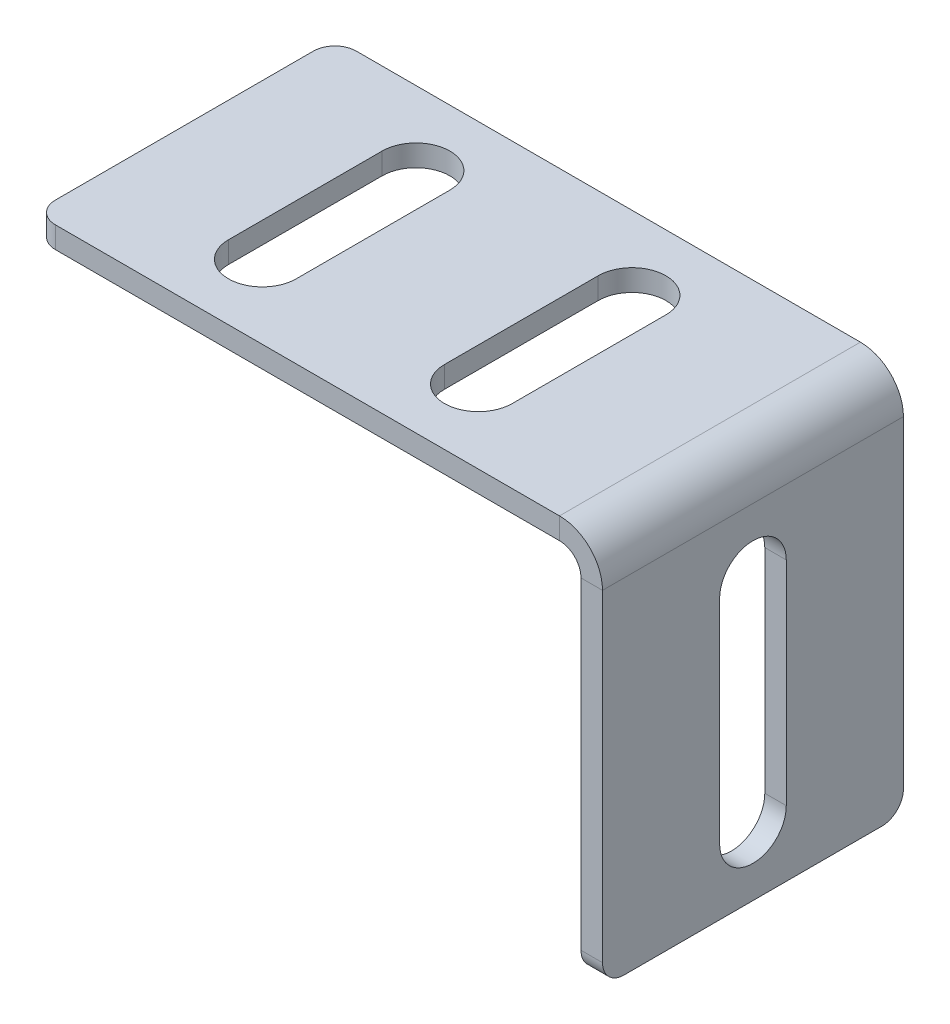
ISO-10303-21;
HEADER;
FILE_DESCRIPTION(('STEP AP214'),'2;1');
FILE_NAME('part.step','',(''),(''),'','','');
FILE_SCHEMA(('AUTOMOTIVE_DESIGN { 1 0 10303 214 1 1 1 1 }'));
ENDSEC;
DATA;
#1=APPLICATION_CONTEXT('core data for automotive mechanical design processes');
#2=APPLICATION_PROTOCOL_DEFINITION('international standard','automotive_design',2000,#1);
#3=PRODUCT_CONTEXT('',#1,'mechanical');
#4=PRODUCT('Part','Part','',(#3));
#5=PRODUCT_RELATED_PRODUCT_CATEGORY('part','',(#4));
#6=PRODUCT_DEFINITION_FORMATION('','',#4);
#7=PRODUCT_DEFINITION_CONTEXT('part definition',#1,'design');
#8=PRODUCT_DEFINITION('design','',#6,#7);
#9=PRODUCT_DEFINITION_SHAPE('','',#8);
#10=(LENGTH_UNIT() NAMED_UNIT(*) SI_UNIT(.MILLI.,.METRE.));
#11=(NAMED_UNIT(*) PLANE_ANGLE_UNIT() SI_UNIT($,.RADIAN.));
#12=(NAMED_UNIT(*) SI_UNIT($,.STERADIAN.) SOLID_ANGLE_UNIT());
#13=UNCERTAINTY_MEASURE_WITH_UNIT(LENGTH_MEASURE(1.E-05),#10,'distance_accuracy_value','');
#14=(GEOMETRIC_REPRESENTATION_CONTEXT(3) GLOBAL_UNCERTAINTY_ASSIGNED_CONTEXT((#13)) GLOBAL_UNIT_ASSIGNED_CONTEXT((#10,
#11,#12)) REPRESENTATION_CONTEXT('',''));
#15=CARTESIAN_POINT('',(0.,0.,0.));
#16=DIRECTION('',(0.,0.,1.));
#17=DIRECTION('',(1.,0.,0.));
#18=AXIS2_PLACEMENT_3D('',#15,#16,#17);
#19=CARTESIAN_POINT('',(-2.,0.,0.));
#20=DIRECTION('',(0.,0.,1.));
#21=DIRECTION('',(0.,1.,0.));
#22=AXIS2_PLACEMENT_3D('',#19,#20,#21);
#23=PLANE('',#22);
#24=DIRECTION('',(0.,-1.,0.));
#25=VECTOR('',#24,1.);
#26=CARTESIAN_POINT('',(0.,0.,0.));
#27=LINE('',#26,#25);
#28=CARTESIAN_POINT('',(0.,-34.,0.));
#29=VERTEX_POINT('',#28);
#30=CARTESIAN_POINT('',(0.,-4.,0.));
#31=VERTEX_POINT('',#30);
#32=EDGE_CURVE('E329',#29,#31,#27,.F.);
#33=ORIENTED_EDGE('',*,*,#32,.F.);
#34=DIRECTION('',(1.,0.,0.));
#35=VECTOR('',#34,1.);
#36=CARTESIAN_POINT('',(-2.,-34.,0.));
#37=LINE('',#36,#35);
#38=CARTESIAN_POINT('',(-2.,-34.,0.));
#39=VERTEX_POINT('',#38);
#40=EDGE_CURVE('E343',#29,#39,#37,.F.);
#41=ORIENTED_EDGE('',*,*,#40,.T.);
#42=DIRECTION('',(0.,1.,0.));
#43=VECTOR('',#42,1.);
#44=CARTESIAN_POINT('',(-2.,0.,0.));
#45=LINE('',#44,#43);
#46=CARTESIAN_POINT('',(-2.,-4.,0.));
#47=VERTEX_POINT('',#46);
#48=EDGE_CURVE('E282',#39,#47,#45,.T.);
#49=ORIENTED_EDGE('',*,*,#48,.T.);
#50=DIRECTION('',(-1.,0.,0.));
#51=VECTOR('',#50,1.);
#52=CARTESIAN_POINT('',(-2.,-4.,0.));
#53=LINE('',#52,#51);
#54=EDGE_CURVE('E340',#31,#47,#53,.T.);
#55=ORIENTED_EDGE('',*,*,#54,.F.);
#56=EDGE_LOOP('',(#33,#41,#49,#55));
#57=FACE_BOUND('',#56,.T.);
#58=ADVANCED_FACE('F16',(#57),#23,.F.);
#59=CARTESIAN_POINT('',(-2.,-36.,91.9875769192738));
#60=DIRECTION('',(0.,1.,0.));
#61=DIRECTION('',(0.,0.,-1.));
#62=AXIS2_PLACEMENT_3D('',#59,#60,#61);
#63=PLANE('',#62);
#64=DIRECTION('',(0.,0.,-1.));
#65=VECTOR('',#64,1.);
#66=CARTESIAN_POINT('',(-2.,-36.,91.9875769192738));
#67=LINE('',#66,#65);
#68=CARTESIAN_POINT('',(-2.,-36.,25.9999999999999));
#69=VERTEX_POINT('',#68);
#70=CARTESIAN_POINT('',(-2.,-36.,2.));
#71=VERTEX_POINT('',#70);
#72=EDGE_CURVE('E285',#69,#71,#67,.T.);
#73=ORIENTED_EDGE('',*,*,#72,.T.);
#74=DIRECTION('',(1.,0.,0.));
#75=VECTOR('',#74,1.);
#76=CARTESIAN_POINT('',(-2.,-36.,2.));
#77=LINE('',#76,#75);
#78=CARTESIAN_POINT('',(0.,-36.,2.));
#79=VERTEX_POINT('',#78);
#80=EDGE_CURVE('E354',#71,#79,#77,.T.);
#81=ORIENTED_EDGE('',*,*,#80,.T.);
#82=DIRECTION('',(0.,0.,1.));
#83=VECTOR('',#82,1.);
#84=CARTESIAN_POINT('',(0.,-36.,91.9875769192738));
#85=LINE('',#84,#83);
#86=CARTESIAN_POINT('',(0.,-36.,25.9999999999999));
#87=VERTEX_POINT('',#86);
#88=EDGE_CURVE('E322',#87,#79,#85,.F.);
#89=ORIENTED_EDGE('',*,*,#88,.F.);
#90=DIRECTION('',(1.,0.,0.));
#91=VECTOR('',#90,1.);
#92=CARTESIAN_POINT('',(-2.,-36.,25.9999999999999));
#93=LINE('',#92,#91);
#94=EDGE_CURVE('E351',#87,#69,#93,.F.);
#95=ORIENTED_EDGE('',*,*,#94,.T.);
#96=EDGE_LOOP('',(#73,#81,#89,#95));
#97=FACE_BOUND('',#96,.T.);
#98=ADVANCED_FACE('F434',(#97),#63,.F.);
#99=CARTESIAN_POINT('',(-2.,0.,27.9999999999999));
#100=DIRECTION('',(0.,0.,-1.));
#101=DIRECTION('',(0.,-1.,0.));
#102=AXIS2_PLACEMENT_3D('',#99,#100,#101);
#103=PLANE('',#102);
#104=DIRECTION('',(0.,-1.,0.));
#105=VECTOR('',#104,1.);
#106=CARTESIAN_POINT('',(-2.,0.,27.9999999999999));
#107=LINE('',#106,#105);
#108=CARTESIAN_POINT('',(-2.,-4.,27.9999999999999));
#109=VERTEX_POINT('',#108);
#110=CARTESIAN_POINT('',(-2.,-34.,27.9999999999999));
#111=VERTEX_POINT('',#110);
#112=EDGE_CURVE('E279',#109,#111,#107,.T.);
#113=ORIENTED_EDGE('',*,*,#112,.T.);
#114=DIRECTION('',(1.,0.,0.));
#115=VECTOR('',#114,1.);
#116=CARTESIAN_POINT('',(-2.,-34.,27.9999999999999));
#117=LINE('',#116,#115);
#118=CARTESIAN_POINT('',(0.,-34.,27.9999999999999));
#119=VERTEX_POINT('',#118);
#120=EDGE_CURVE('E360',#111,#119,#117,.T.);
#121=ORIENTED_EDGE('',*,*,#120,.T.);
#122=DIRECTION('',(0.,-1.,0.));
#123=VECTOR('',#122,1.);
#124=CARTESIAN_POINT('',(0.,0.,27.9999999999999));
#125=LINE('',#124,#123);
#126=CARTESIAN_POINT('',(0.,-4.,27.9999999999999));
#127=VERTEX_POINT('',#126);
#128=EDGE_CURVE('E326',#127,#119,#125,.T.);
#129=ORIENTED_EDGE('',*,*,#128,.F.);
#130=DIRECTION('',(-1.,0.,0.));
#131=VECTOR('',#130,1.);
#132=CARTESIAN_POINT('',(-2.,-4.,27.9999999999999));
#133=LINE('',#132,#131);
#134=EDGE_CURVE('E338',#127,#109,#133,.T.);
#135=ORIENTED_EDGE('',*,*,#134,.T.);
#136=EDGE_LOOP('',(#113,#121,#129,#135));
#137=FACE_BOUND('',#136,.T.);
#138=ADVANCED_FACE('F425',(#137),#103,.F.);
#139=CARTESIAN_POINT('',(-4.,-4.,27.9999999999999));
#140=DIRECTION('',(0.,0.,1.));
#141=DIRECTION('',(1.,0.,0.));
#142=AXIS2_PLACEMENT_3D('',#139,#140,#141);
#143=PLANE('',#142);
#144=ORIENTED_EDGE('',*,*,#134,.F.);
#145=CARTESIAN_POINT('',(-4.,-4.,27.9999999999999));
#146=DIRECTION('',(0.,0.,1.));
#147=DIRECTION('',(1.,0.,0.));
#148=AXIS2_PLACEMENT_3D('',#145,#146,#147);
#149=CIRCLE('',#148,4.);
#150=CARTESIAN_POINT('',(-4.,0.,27.9999999999999));
#151=VERTEX_POINT('',#150);
#152=EDGE_CURVE('E323',#127,#151,#149,.T.);
#153=ORIENTED_EDGE('',*,*,#152,.T.);
#154=DIRECTION('',(0.,-1.,0.));
#155=VECTOR('',#154,1.);
#156=CARTESIAN_POINT('',(-4.,-2.,27.9999999999999));
#157=LINE('',#156,#155);
#158=CARTESIAN_POINT('',(-4.,-2.,27.9999999999999));
#159=VERTEX_POINT('',#158);
#160=EDGE_CURVE('E335',#151,#159,#157,.T.);
#161=ORIENTED_EDGE('',*,*,#160,.T.);
#162=CARTESIAN_POINT('',(-4.,-4.,27.9999999999999));
#163=DIRECTION('',(0.,0.,-1.));
#164=DIRECTION('',(-1.,0.,0.));
#165=AXIS2_PLACEMENT_3D('',#162,#163,#164);
#166=CIRCLE('',#165,2.);
#167=EDGE_CURVE('E283',#109,#159,#166,.F.);
#168=ORIENTED_EDGE('',*,*,#167,.F.);
#169=EDGE_LOOP('',(#144,#153,#161,#168));
#170=FACE_BOUND('',#169,.T.);
#171=ADVANCED_FACE('F418',(#170),#143,.T.);
#172=CARTESIAN_POINT('',(0.,-2.,27.9999999999999));
#173=DIRECTION('',(0.,0.,-1.));
#174=DIRECTION('',(1.,0.,0.));
#175=AXIS2_PLACEMENT_3D('',#172,#173,#174);
#176=PLANE('',#175);
#177=DIRECTION('',(1.,0.,0.));
#178=VECTOR('',#177,1.);
#179=CARTESIAN_POINT('',(0.,0.,27.9999999999999));
#180=LINE('',#179,#178);
#181=CARTESIAN_POINT('',(-50.9,0.,27.9999999999999));
#182=VERTEX_POINT('',#181);
#183=EDGE_CURVE('E320',#182,#151,#180,.T.);
#184=ORIENTED_EDGE('',*,*,#183,.F.);
#185=DIRECTION('',(0.,-1.,0.));
#186=VECTOR('',#185,1.);
#187=CARTESIAN_POINT('',(-50.9,-2.00000000000001,27.9999999999999));
#188=LINE('',#187,#186);
#189=CARTESIAN_POINT('',(-50.9,-2.00000000000001,27.9999999999999));
#190=VERTEX_POINT('',#189);
#191=EDGE_CURVE('E362',#182,#190,#188,.T.);
#192=ORIENTED_EDGE('',*,*,#191,.T.);
#193=DIRECTION('',(1.,0.,0.));
#194=VECTOR('',#193,1.);
#195=CARTESIAN_POINT('',(0.,-2.,27.9999999999999));
#196=LINE('',#195,#194);
#197=EDGE_CURVE('E288',#190,#159,#196,.T.);
#198=ORIENTED_EDGE('',*,*,#197,.T.);
#199=ORIENTED_EDGE('',*,*,#160,.F.);
#200=EDGE_LOOP('',(#184,#192,#198,#199));
#201=FACE_BOUND('',#200,.T.);
#202=ADVANCED_FACE('F386',(#201),#176,.F.);
#203=CARTESIAN_POINT('',(-52.9,-2.00000000000001,91.9875769192738));
#204=DIRECTION('',(-1.,0.,0.));
#205=DIRECTION('',(0.,0.,-1.));
#206=AXIS2_PLACEMENT_3D('',#203,#204,#205);
#207=PLANE('',#206);
#208=DIRECTION('',(0.,0.,-1.));
#209=VECTOR('',#208,1.);
#210=CARTESIAN_POINT('',(-52.9,-2.00000000000001,91.9875769192738));
#211=LINE('',#210,#209);
#212=CARTESIAN_POINT('',(-52.9,-2.00000000000001,25.9999999999999));
#213=VERTEX_POINT('',#212);
#214=CARTESIAN_POINT('',(-52.9,-2.00000000000001,2.));
#215=VERTEX_POINT('',#214);
#216=EDGE_CURVE('E290',#213,#215,#211,.T.);
#217=ORIENTED_EDGE('',*,*,#216,.F.);
#218=DIRECTION('',(0.,1.,0.));
#219=VECTOR('',#218,1.);
#220=CARTESIAN_POINT('',(-52.9,-2.00000000000001,25.9999999999999));
#221=LINE('',#220,#219);
#222=CARTESIAN_POINT('',(-52.9,0.,25.9999999999999));
#223=VERTEX_POINT('',#222);
#224=EDGE_CURVE('E372',#213,#223,#221,.T.);
#225=ORIENTED_EDGE('',*,*,#224,.T.);
#226=DIRECTION('',(0.,0.,1.));
#227=VECTOR('',#226,1.);
#228=CARTESIAN_POINT('',(-52.9,0.,91.9875769192738));
#229=LINE('',#228,#227);
#230=CARTESIAN_POINT('',(-52.9,0.,2.));
#231=VERTEX_POINT('',#230);
#232=EDGE_CURVE('E317',#223,#231,#229,.F.);
#233=ORIENTED_EDGE('',*,*,#232,.T.);
#234=DIRECTION('',(0.,1.,0.));
#235=VECTOR('',#234,1.);
#236=CARTESIAN_POINT('',(-52.9,-2.00000000000001,2.));
#237=LINE('',#236,#235);
#238=EDGE_CURVE('E369',#231,#215,#237,.F.);
#239=ORIENTED_EDGE('',*,*,#238,.T.);
#240=EDGE_LOOP('',(#217,#225,#233,#239));
#241=FACE_BOUND('',#240,.T.);
#242=ADVANCED_FACE('F392',(#241),#207,.T.);
#243=CARTESIAN_POINT('',(0.,-2.,0.));
#244=DIRECTION('',(0.,0.,1.));
#245=DIRECTION('',(-1.,0.,0.));
#246=AXIS2_PLACEMENT_3D('',#243,#244,#245);
#247=PLANE('',#246);
#248=DIRECTION('',(-1.,0.,0.));
#249=VECTOR('',#248,1.);
#250=CARTESIAN_POINT('',(0.,-2.,0.));
#251=LINE('',#250,#249);
#252=CARTESIAN_POINT('',(-4.,-2.,0.));
#253=VERTEX_POINT('',#252);
#254=CARTESIAN_POINT('',(-50.9,-2.00000000000001,0.));
#255=VERTEX_POINT('',#254);
#256=EDGE_CURVE('E293',#253,#255,#251,.T.);
#257=ORIENTED_EDGE('',*,*,#256,.T.);
#258=DIRECTION('',(0.,-1.,0.));
#259=VECTOR('',#258,1.);
#260=CARTESIAN_POINT('',(-50.9,-2.00000000000001,0.));
#261=LINE('',#260,#259);
#262=CARTESIAN_POINT('',(-50.9,0.,0.));
#263=VERTEX_POINT('',#262);
#264=EDGE_CURVE('E10',#255,#263,#261,.F.);
#265=ORIENTED_EDGE('',*,*,#264,.T.);
#266=DIRECTION('',(1.,0.,0.));
#267=VECTOR('',#266,1.);
#268=CARTESIAN_POINT('',(0.,0.,0.));
#269=LINE('',#268,#267);
#270=CARTESIAN_POINT('',(-4.,0.,0.));
#271=VERTEX_POINT('',#270);
#272=EDGE_CURVE('E314',#271,#263,#269,.F.);
#273=ORIENTED_EDGE('',*,*,#272,.F.);
#274=DIRECTION('',(0.,-1.,0.));
#275=VECTOR('',#274,1.);
#276=CARTESIAN_POINT('',(-4.,-2.,0.));
#277=LINE('',#276,#275);
#278=EDGE_CURVE('E302',#271,#253,#277,.T.);
#279=ORIENTED_EDGE('',*,*,#278,.T.);
#280=EDGE_LOOP('',(#257,#265,#273,#279));
#281=FACE_BOUND('',#280,.T.);
#282=ADVANCED_FACE('F400',(#281),#247,.F.);
#283=CARTESIAN_POINT('',(-4.,-4.,0.));
#284=DIRECTION('',(0.,0.,-1.));
#285=DIRECTION('',(-1.,0.,0.));
#286=AXIS2_PLACEMENT_3D('',#283,#284,#285);
#287=PLANE('',#286);
#288=CARTESIAN_POINT('',(-4.,-4.,0.));
#289=DIRECTION('',(0.,0.,1.));
#290=DIRECTION('',(1.,0.,0.));
#291=AXIS2_PLACEMENT_3D('',#288,#289,#290);
#292=CIRCLE('',#291,4.);
#293=EDGE_CURVE('E190',#271,#31,#292,.F.);
#294=ORIENTED_EDGE('',*,*,#293,.T.);
#295=ORIENTED_EDGE('',*,*,#54,.T.);
#296=CARTESIAN_POINT('',(-4.,-4.,0.));
#297=DIRECTION('',(0.,0.,1.));
#298=DIRECTION('',(1.,0.,0.));
#299=AXIS2_PLACEMENT_3D('',#296,#297,#298);
#300=CIRCLE('',#299,2.);
#301=EDGE_CURVE('E303',#253,#47,#300,.F.);
#302=ORIENTED_EDGE('',*,*,#301,.F.);
#303=ORIENTED_EDGE('',*,*,#278,.F.);
#304=EDGE_LOOP('',(#294,#295,#302,#303));
#305=FACE_BOUND('',#304,.T.);
#306=ADVANCED_FACE('F404',(#305),#287,.T.);
#307=CARTESIAN_POINT('',(0.,-2.,91.9875769192738));
#308=DIRECTION('',(0.,-1.,0.));
#309=DIRECTION('',(1.,0.,0.));
#310=AXIS2_PLACEMENT_3D('',#307,#308,#309);
#311=PLANE('',#310);
#312=DIRECTION('',(0.,0.,1.));
#313=VECTOR('',#312,1.);
#314=CARTESIAN_POINT('',(-41.65,-2.00000000000001,6.84999999997452));
#315=LINE('',#314,#313);
#316=CARTESIAN_POINT('',(-41.65,-2.00000000000001,6.84999999997452));
#317=VERTEX_POINT('',#316);
#318=CARTESIAN_POINT('',(-41.65,-2.00000000000001,21.1500000000254));
#319=VERTEX_POINT('',#318);
#320=EDGE_CURVE('E180',#317,#319,#315,.T.);
#321=ORIENTED_EDGE('',*,*,#320,.T.);
#322=CARTESIAN_POINT('',(-38.5,-2.00000000000001,21.15));
#323=DIRECTION('',(0.,-1.,0.));
#324=DIRECTION('',(1.,0.,0.));
#325=AXIS2_PLACEMENT_3D('',#322,#323,#324);
#326=CIRCLE('',#325,3.15);
#327=CARTESIAN_POINT('',(-35.35,-2.00000000000001,21.15));
#328=VERTEX_POINT('',#327);
#329=EDGE_CURVE('E185',#328,#319,#326,.T.);
#330=ORIENTED_EDGE('',*,*,#329,.F.);
#331=DIRECTION('',(0.,0.,-1.));
#332=VECTOR('',#331,1.);
#333=CARTESIAN_POINT('',(-35.35,-2.00000000000001,9.7999999999999));
#334=LINE('',#333,#332);
#335=CARTESIAN_POINT('',(-35.35,-2.00000000000001,6.84999999999991));
#336=VERTEX_POINT('',#335);
#337=EDGE_CURVE('E31',#328,#336,#334,.T.);
#338=ORIENTED_EDGE('',*,*,#337,.T.);
#339=CARTESIAN_POINT('',(-38.5,-2.00000000000001,6.84999999999991));
#340=DIRECTION('',(0.,-1.,0.));
#341=DIRECTION('',(1.,0.,0.));
#342=AXIS2_PLACEMENT_3D('',#339,#340,#341);
#343=CIRCLE('',#342,3.15);
#344=EDGE_CURVE('E186',#336,#317,#343,.F.);
#345=ORIENTED_EDGE('',*,*,#344,.T.);
#346=EDGE_LOOP('',(#321,#330,#338,#345));
#347=FACE_BOUND('',#346,.T.);
#348=DIRECTION('',(0.,0.,1.));
#349=VECTOR('',#348,1.);
#350=CARTESIAN_POINT('',(-21.55,-2.,6.84999999999991));
#351=LINE('',#350,#349);
#352=CARTESIAN_POINT('',(-21.55,-2.,6.84999999999991));
#353=VERTEX_POINT('',#352);
#354=CARTESIAN_POINT('',(-21.55,-2.,21.15));
#355=VERTEX_POINT('',#354);
#356=EDGE_CURVE('E251',#353,#355,#351,.T.);
#357=ORIENTED_EDGE('',*,*,#356,.T.);
#358=CARTESIAN_POINT('',(-18.4,-2.,21.15));
#359=DIRECTION('',(0.,-1.,0.));
#360=DIRECTION('',(1.,0.,0.));
#361=AXIS2_PLACEMENT_3D('',#358,#359,#360);
#362=CIRCLE('',#361,3.15);
#363=CARTESIAN_POINT('',(-15.25,-2.,21.15));
#364=VERTEX_POINT('',#363);
#365=EDGE_CURVE('E217',#364,#355,#362,.T.);
#366=ORIENTED_EDGE('',*,*,#365,.F.);
#367=DIRECTION('',(0.,0.,-1.));
#368=VECTOR('',#367,1.);
#369=CARTESIAN_POINT('',(-15.25,-2.,9.7999999999999));
#370=LINE('',#369,#368);
#371=CARTESIAN_POINT('',(-15.25,-2.,6.84999999999991));
#372=VERTEX_POINT('',#371);
#373=EDGE_CURVE('E39',#364,#372,#370,.T.);
#374=ORIENTED_EDGE('',*,*,#373,.T.);
#375=CARTESIAN_POINT('',(-18.4,-2.,6.84999999999991));
#376=DIRECTION('',(0.,-1.,0.));
#377=DIRECTION('',(1.,0.,0.));
#378=AXIS2_PLACEMENT_3D('',#375,#376,#377);
#379=CIRCLE('',#378,3.15);
#380=EDGE_CURVE('E263',#372,#353,#379,.F.);
#381=ORIENTED_EDGE('',*,*,#380,.T.);
#382=EDGE_LOOP('',(#357,#366,#374,#381));
#383=FACE_BOUND('',#382,.T.);
#384=ORIENTED_EDGE('',*,*,#197,.F.);
#385=CARTESIAN_POINT('',(-50.9,-2.00000000000001,25.9999999999999));
#386=DIRECTION('',(0.,-1.,0.));
#387=DIRECTION('',(1.,0.,0.));
#388=AXIS2_PLACEMENT_3D('',#385,#386,#387);
#389=CIRCLE('',#388,2.);
#390=EDGE_CURVE('E367',#190,#213,#389,.T.);
#391=ORIENTED_EDGE('',*,*,#390,.T.);
#392=ORIENTED_EDGE('',*,*,#216,.T.);
#393=CARTESIAN_POINT('',(-50.9,-2.00000000000001,2.));
#394=DIRECTION('',(0.,-1.,0.));
#395=DIRECTION('',(1.,0.,0.));
#396=AXIS2_PLACEMENT_3D('',#393,#394,#395);
#397=CIRCLE('',#396,2.);
#398=EDGE_CURVE('E365',#215,#255,#397,.T.);
#399=ORIENTED_EDGE('',*,*,#398,.T.);
#400=ORIENTED_EDGE('',*,*,#256,.F.);
#401=DIRECTION('',(0.,0.,-1.));
#402=VECTOR('',#401,1.);
#403=CARTESIAN_POINT('',(-4.,-2.,27.9999999999999));
#404=LINE('',#403,#402);
#405=EDGE_CURVE('E299',#253,#159,#404,.F.);
#406=ORIENTED_EDGE('',*,*,#405,.T.);
#407=EDGE_LOOP('',(#384,#391,#392,#399,#400,#406));
#408=FACE_BOUND('',#407,.T.);
#409=ADVANCED_FACE('F182',(#347,#383,#408),#311,.T.);
#410=CARTESIAN_POINT('',(-2.,0.,91.9875769192738));
#411=DIRECTION('',(-1.,0.,0.));
#412=DIRECTION('',(0.,-1.,0.));
#413=AXIS2_PLACEMENT_3D('',#410,#411,#412);
#414=PLANE('',#413);
#415=CARTESIAN_POINT('',(-2.,-29.9,14.));
#416=DIRECTION('',(-1.,0.,0.));
#417=DIRECTION('',(0.,-1.,0.));
#418=AXIS2_PLACEMENT_3D('',#415,#416,#417);
#419=CIRCLE('',#418,3.1);
#420=CARTESIAN_POINT('',(-2.,-29.9,10.8999999999999));
#421=VERTEX_POINT('',#420);
#422=CARTESIAN_POINT('',(-2.,-29.9,17.0999999999999));
#423=VERTEX_POINT('',#422);
#424=EDGE_CURVE('E227',#421,#423,#419,.T.);
#425=ORIENTED_EDGE('',*,*,#424,.F.);
#426=DIRECTION('',(0.,-1.,0.));
#427=VECTOR('',#426,1.);
#428=CARTESIAN_POINT('',(-2.,-29.9,10.8999999999999));
#429=LINE('',#428,#427);
#430=CARTESIAN_POINT('',(-2.,-10.1,10.8999999999999));
#431=VERTEX_POINT('',#430);
#432=EDGE_CURVE('E235',#431,#421,#429,.T.);
#433=ORIENTED_EDGE('',*,*,#432,.F.);
#434=CARTESIAN_POINT('',(-2.,-10.1,14.));
#435=DIRECTION('',(-1.,0.,0.));
#436=DIRECTION('',(0.,-1.,0.));
#437=AXIS2_PLACEMENT_3D('',#434,#435,#436);
#438=CIRCLE('',#437,3.1);
#439=CARTESIAN_POINT('',(-2.,-10.1,17.1));
#440=VERTEX_POINT('',#439);
#441=EDGE_CURVE('E232',#440,#431,#438,.T.);
#442=ORIENTED_EDGE('',*,*,#441,.F.);
#443=DIRECTION('',(0.,1.,0.));
#444=VECTOR('',#443,1.);
#445=CARTESIAN_POINT('',(-2.,-29.9,17.0999999999999));
#446=LINE('',#445,#444);
#447=EDGE_CURVE('E229',#423,#440,#446,.T.);
#448=ORIENTED_EDGE('',*,*,#447,.F.);
#449=EDGE_LOOP('',(#425,#433,#442,#448));
#450=FACE_BOUND('',#449,.T.);
#451=ORIENTED_EDGE('',*,*,#48,.F.);
#452=CARTESIAN_POINT('',(-2.,-34.,2.));
#453=DIRECTION('',(-1.,0.,0.));
#454=DIRECTION('',(0.,-1.,0.));
#455=AXIS2_PLACEMENT_3D('',#452,#453,#454);
#456=CIRCLE('',#455,2.);
#457=EDGE_CURVE('E349',#39,#71,#456,.T.);
#458=ORIENTED_EDGE('',*,*,#457,.T.);
#459=ORIENTED_EDGE('',*,*,#72,.F.);
#460=CARTESIAN_POINT('',(-2.,-34.,25.9999999999999));
#461=DIRECTION('',(-1.,0.,0.));
#462=DIRECTION('',(0.,-1.,0.));
#463=AXIS2_PLACEMENT_3D('',#460,#461,#462);
#464=CIRCLE('',#463,2.);
#465=EDGE_CURVE('E347',#69,#111,#464,.T.);
#466=ORIENTED_EDGE('',*,*,#465,.T.);
#467=ORIENTED_EDGE('',*,*,#112,.F.);
#468=DIRECTION('',(0.,0.,-1.));
#469=VECTOR('',#468,1.);
#470=CARTESIAN_POINT('',(-2.,-4.,0.));
#471=LINE('',#470,#469);
#472=EDGE_CURVE('E296',#109,#47,#471,.T.);
#473=ORIENTED_EDGE('',*,*,#472,.T.);
#474=EDGE_LOOP('',(#451,#458,#459,#466,#467,#473));
#475=FACE_BOUND('',#474,.T.);
#476=ADVANCED_FACE('F412',(#450,#475),#414,.T.);
#477=CARTESIAN_POINT('',(-4.,-4.,91.9875769192738));
#478=DIRECTION('',(0.,0.,1.));
#479=DIRECTION('',(1.,0.,0.));
#480=AXIS2_PLACEMENT_3D('',#477,#478,#479);
#481=CYLINDRICAL_SURFACE('',#480,2.);
#482=ORIENTED_EDGE('',*,*,#167,.T.);
#483=ORIENTED_EDGE('',*,*,#405,.F.);
#484=ORIENTED_EDGE('',*,*,#301,.T.);
#485=ORIENTED_EDGE('',*,*,#472,.F.);
#486=EDGE_LOOP('',(#482,#483,#484,#485));
#487=FACE_BOUND('',#486,.T.);
#488=ADVANCED_FACE('F408',(#487),#481,.F.);
#489=CARTESIAN_POINT('',(0.,0.,91.9875769192738));
#490=DIRECTION('',(0.,-1.,0.));
#491=DIRECTION('',(1.,0.,0.));
#492=AXIS2_PLACEMENT_3D('',#489,#490,#491);
#493=PLANE('',#492);
#494=CARTESIAN_POINT('',(-38.5,0.,21.15));
#495=DIRECTION('',(0.,-1.,0.));
#496=DIRECTION('',(-1.,0.,0.));
#497=AXIS2_PLACEMENT_3D('',#494,#495,#496);
#498=CIRCLE('',#497,3.15);
#499=CARTESIAN_POINT('',(-35.35,0.,21.15));
#500=VERTEX_POINT('',#499);
#501=CARTESIAN_POINT('',(-41.65,0.,21.1500000000254));
#502=VERTEX_POINT('',#501);
#503=EDGE_CURVE('E220',#500,#502,#498,.T.);
#504=ORIENTED_EDGE('',*,*,#503,.T.);
#505=DIRECTION('',(0.,0.,1.));
#506=VECTOR('',#505,1.);
#507=CARTESIAN_POINT('',(-41.65,0.,6.84999999997452));
#508=LINE('',#507,#506);
#509=CARTESIAN_POINT('',(-41.65,0.,6.84999999997453));
#510=VERTEX_POINT('',#509);
#511=EDGE_CURVE('E197',#510,#502,#508,.T.);
#512=ORIENTED_EDGE('',*,*,#511,.F.);
#513=CARTESIAN_POINT('',(-38.5,0.,6.84999999999991));
#514=DIRECTION('',(0.,1.,0.));
#515=DIRECTION('',(-1.,0.,0.));
#516=AXIS2_PLACEMENT_3D('',#513,#514,#515);
#517=CIRCLE('',#516,3.15);
#518=CARTESIAN_POINT('',(-35.35,0.,6.84999999999991));
#519=VERTEX_POINT('',#518);
#520=EDGE_CURVE('E257',#519,#510,#517,.T.);
#521=ORIENTED_EDGE('',*,*,#520,.F.);
#522=DIRECTION('',(0.,0.,-1.));
#523=VECTOR('',#522,1.);
#524=CARTESIAN_POINT('',(-35.35,0.,9.7999999999999));
#525=LINE('',#524,#523);
#526=EDGE_CURVE('E254',#500,#519,#525,.T.);
#527=ORIENTED_EDGE('',*,*,#526,.F.);
#528=EDGE_LOOP('',(#504,#512,#521,#527));
#529=FACE_BOUND('',#528,.T.);
#530=CARTESIAN_POINT('',(-18.4,0.,21.15));
#531=DIRECTION('',(0.,-1.,0.));
#532=DIRECTION('',(-1.,0.,0.));
#533=AXIS2_PLACEMENT_3D('',#530,#531,#532);
#534=CIRCLE('',#533,3.15);
#535=CARTESIAN_POINT('',(-15.25,0.,21.15));
#536=VERTEX_POINT('',#535);
#537=CARTESIAN_POINT('',(-21.55,0.,21.15));
#538=VERTEX_POINT('',#537);
#539=EDGE_CURVE('E210',#536,#538,#534,.T.);
#540=ORIENTED_EDGE('',*,*,#539,.T.);
#541=DIRECTION('',(0.,0.,1.));
#542=VECTOR('',#541,1.);
#543=CARTESIAN_POINT('',(-21.55,0.,6.84999999999991));
#544=LINE('',#543,#542);
#545=CARTESIAN_POINT('',(-21.55,0.,6.84999999999991));
#546=VERTEX_POINT('',#545);
#547=EDGE_CURVE('E266',#546,#538,#544,.T.);
#548=ORIENTED_EDGE('',*,*,#547,.F.);
#549=CARTESIAN_POINT('',(-18.4,0.,6.84999999999991));
#550=DIRECTION('',(0.,1.,0.));
#551=DIRECTION('',(-1.,0.,0.));
#552=AXIS2_PLACEMENT_3D('',#549,#550,#551);
#553=CIRCLE('',#552,3.15);
#554=CARTESIAN_POINT('',(-15.25,0.,6.84999999999991));
#555=VERTEX_POINT('',#554);
#556=EDGE_CURVE('E271',#555,#546,#553,.T.);
#557=ORIENTED_EDGE('',*,*,#556,.F.);
#558=DIRECTION('',(0.,0.,-1.));
#559=VECTOR('',#558,1.);
#560=CARTESIAN_POINT('',(-15.25,0.,9.7999999999999));
#561=LINE('',#560,#559);
#562=EDGE_CURVE('E268',#536,#555,#561,.T.);
#563=ORIENTED_EDGE('',*,*,#562,.F.);
#564=EDGE_LOOP('',(#540,#548,#557,#563));
#565=FACE_BOUND('',#564,.T.);
#566=ORIENTED_EDGE('',*,*,#232,.F.);
#567=CARTESIAN_POINT('',(-50.9,0.,25.9999999999999));
#568=DIRECTION('',(0.,-1.,0.));
#569=DIRECTION('',(1.,0.,0.));
#570=AXIS2_PLACEMENT_3D('',#567,#568,#569);
#571=CIRCLE('',#570,2.);
#572=EDGE_CURVE('E24',#223,#182,#571,.F.);
#573=ORIENTED_EDGE('',*,*,#572,.T.);
#574=ORIENTED_EDGE('',*,*,#183,.T.);
#575=DIRECTION('',(0.,0.,1.));
#576=VECTOR('',#575,1.);
#577=CARTESIAN_POINT('',(-4.,0.,91.9875769192738));
#578=LINE('',#577,#576);
#579=EDGE_CURVE('E306',#271,#151,#578,.T.);
#580=ORIENTED_EDGE('',*,*,#579,.F.);
#581=ORIENTED_EDGE('',*,*,#272,.T.);
#582=CARTESIAN_POINT('',(-50.9,0.,2.));
#583=DIRECTION('',(0.,-1.,0.));
#584=DIRECTION('',(1.,0.,0.));
#585=AXIS2_PLACEMENT_3D('',#582,#583,#584);
#586=CIRCLE('',#585,2.);
#587=EDGE_CURVE('E374',#263,#231,#586,.F.);
#588=ORIENTED_EDGE('',*,*,#587,.T.);
#589=EDGE_LOOP('',(#566,#573,#574,#580,#581,#588));
#590=FACE_BOUND('',#589,.T.);
#591=ADVANCED_FACE('F379',(#529,#565,#590),#493,.F.);
#592=CARTESIAN_POINT('',(0.,0.,91.9875769192738));
#593=DIRECTION('',(-1.,0.,0.));
#594=DIRECTION('',(0.,-1.,0.));
#595=AXIS2_PLACEMENT_3D('',#592,#593,#594);
#596=PLANE('',#595);
#597=DIRECTION('',(0.,1.,0.));
#598=VECTOR('',#597,1.);
#599=CARTESIAN_POINT('',(0.,-29.9,10.8999999999999));
#600=LINE('',#599,#598);
#601=CARTESIAN_POINT('',(0.,-29.9,10.8999999999999));
#602=VERTEX_POINT('',#601);
#603=CARTESIAN_POINT('',(0.,-10.1,10.8999999999999));
#604=VERTEX_POINT('',#603);
#605=EDGE_CURVE('E206',#602,#604,#600,.T.);
#606=ORIENTED_EDGE('',*,*,#605,.F.);
#607=CARTESIAN_POINT('',(0.,-29.9,14.));
#608=DIRECTION('',(-1.,0.,0.));
#609=DIRECTION('',(0.,-1.,0.));
#610=AXIS2_PLACEMENT_3D('',#607,#608,#609);
#611=CIRCLE('',#610,3.1);
#612=CARTESIAN_POINT('',(0.,-29.9,17.0999999999999));
#613=VERTEX_POINT('',#612);
#614=EDGE_CURVE('E224',#613,#602,#611,.F.);
#615=ORIENTED_EDGE('',*,*,#614,.F.);
#616=DIRECTION('',(0.,-1.,0.));
#617=VECTOR('',#616,1.);
#618=CARTESIAN_POINT('',(0.,-29.9,17.0999999999999));
#619=LINE('',#618,#617);
#620=CARTESIAN_POINT('',(0.,-10.1,17.0999999999999));
#621=VERTEX_POINT('',#620);
#622=EDGE_CURVE('E241',#621,#613,#619,.T.);
#623=ORIENTED_EDGE('',*,*,#622,.F.);
#624=CARTESIAN_POINT('',(0.,-10.1,14.));
#625=DIRECTION('',(-1.,0.,0.));
#626=DIRECTION('',(0.,-1.,0.));
#627=AXIS2_PLACEMENT_3D('',#624,#625,#626);
#628=CIRCLE('',#627,3.1);
#629=EDGE_CURVE('E204',#604,#621,#628,.F.);
#630=ORIENTED_EDGE('',*,*,#629,.F.);
#631=EDGE_LOOP('',(#606,#615,#623,#630));
#632=FACE_BOUND('',#631,.T.);
#633=ORIENTED_EDGE('',*,*,#88,.T.);
#634=CARTESIAN_POINT('',(0.,-34.,2.));
#635=DIRECTION('',(-1.,0.,0.));
#636=DIRECTION('',(0.,-1.,0.));
#637=AXIS2_PLACEMENT_3D('',#634,#635,#636);
#638=CIRCLE('',#637,2.);
#639=EDGE_CURVE('E358',#79,#29,#638,.F.);
#640=ORIENTED_EDGE('',*,*,#639,.T.);
#641=ORIENTED_EDGE('',*,*,#32,.T.);
#642=DIRECTION('',(0.,0.,1.));
#643=VECTOR('',#642,1.);
#644=CARTESIAN_POINT('',(0.,-4.,91.9875769192738));
#645=LINE('',#644,#643);
#646=EDGE_CURVE('E311',#127,#31,#645,.F.);
#647=ORIENTED_EDGE('',*,*,#646,.F.);
#648=ORIENTED_EDGE('',*,*,#128,.T.);
#649=CARTESIAN_POINT('',(0.,-34.,25.9999999999999));
#650=DIRECTION('',(-1.,0.,0.));
#651=DIRECTION('',(0.,-1.,0.));
#652=AXIS2_PLACEMENT_3D('',#649,#650,#651);
#653=CIRCLE('',#652,2.);
#654=EDGE_CURVE('E356',#119,#87,#653,.F.);
#655=ORIENTED_EDGE('',*,*,#654,.T.);
#656=EDGE_LOOP('',(#633,#640,#641,#647,#648,#655));
#657=FACE_BOUND('',#656,.T.);
#658=ADVANCED_FACE('F428',(#632,#657),#596,.F.);
#659=CARTESIAN_POINT('',(-4.,-4.,91.9875769192738));
#660=DIRECTION('',(0.,0.,1.));
#661=DIRECTION('',(1.,0.,0.));
#662=AXIS2_PLACEMENT_3D('',#659,#660,#661);
#663=CYLINDRICAL_SURFACE('',#662,4.);
#664=ORIENTED_EDGE('',*,*,#152,.F.);
#665=ORIENTED_EDGE('',*,*,#646,.T.);
#666=ORIENTED_EDGE('',*,*,#293,.F.);
#667=ORIENTED_EDGE('',*,*,#579,.T.);
#668=EDGE_LOOP('',(#664,#665,#666,#667));
#669=FACE_BOUND('',#668,.T.);
#670=ADVANCED_FACE('F423',(#669),#663,.T.);
#671=CARTESIAN_POINT('',(-2.,-34.,2.));
#672=DIRECTION('',(-1.,0.,0.));
#673=DIRECTION('',(0.,-1.,0.));
#674=AXIS2_PLACEMENT_3D('',#671,#672,#673);
#675=CYLINDRICAL_SURFACE('',#674,2.);
#676=ORIENTED_EDGE('',*,*,#639,.F.);
#677=ORIENTED_EDGE('',*,*,#80,.F.);
#678=ORIENTED_EDGE('',*,*,#457,.F.);
#679=ORIENTED_EDGE('',*,*,#40,.F.);
#680=EDGE_LOOP('',(#676,#677,#678,#679));
#681=FACE_BOUND('',#680,.T.);
#682=ADVANCED_FACE('F439',(#681),#675,.T.);
#683=CARTESIAN_POINT('',(-2.,-34.,25.9999999999999));
#684=DIRECTION('',(-1.,0.,0.));
#685=DIRECTION('',(0.,-1.,0.));
#686=AXIS2_PLACEMENT_3D('',#683,#684,#685);
#687=CYLINDRICAL_SURFACE('',#686,2.);
#688=ORIENTED_EDGE('',*,*,#654,.F.);
#689=ORIENTED_EDGE('',*,*,#120,.F.);
#690=ORIENTED_EDGE('',*,*,#465,.F.);
#691=ORIENTED_EDGE('',*,*,#94,.F.);
#692=EDGE_LOOP('',(#688,#689,#690,#691));
#693=FACE_BOUND('',#692,.T.);
#694=ADVANCED_FACE('F432',(#693),#687,.T.);
#695=CARTESIAN_POINT('',(-50.9,-2.00000000000001,25.9999999999999));
#696=DIRECTION('',(0.,1.,0.));
#697=DIRECTION('',(-1.,0.,0.));
#698=AXIS2_PLACEMENT_3D('',#695,#696,#697);
#699=CYLINDRICAL_SURFACE('',#698,2.);
#700=ORIENTED_EDGE('',*,*,#572,.F.);
#701=ORIENTED_EDGE('',*,*,#224,.F.);
#702=ORIENTED_EDGE('',*,*,#390,.F.);
#703=ORIENTED_EDGE('',*,*,#191,.F.);
#704=EDGE_LOOP('',(#700,#701,#702,#703));
#705=FACE_BOUND('',#704,.T.);
#706=ADVANCED_FACE('F388',(#705),#699,.T.);
#707=CARTESIAN_POINT('',(-50.9,-2.00000000000001,2.));
#708=DIRECTION('',(0.,1.,0.));
#709=DIRECTION('',(-1.,0.,0.));
#710=AXIS2_PLACEMENT_3D('',#707,#708,#709);
#711=CYLINDRICAL_SURFACE('',#710,2.);
#712=ORIENTED_EDGE('',*,*,#587,.F.);
#713=ORIENTED_EDGE('',*,*,#264,.F.);
#714=ORIENTED_EDGE('',*,*,#398,.F.);
#715=ORIENTED_EDGE('',*,*,#238,.F.);
#716=EDGE_LOOP('',(#712,#713,#714,#715));
#717=FACE_BOUND('',#716,.T.);
#718=ADVANCED_FACE('F18',(#717),#711,.T.);
#719=CARTESIAN_POINT('',(-18.4,-36.001,6.84999999999991));
#720=DIRECTION('',(0.,1.,0.));
#721=DIRECTION('',(-1.,0.,0.));
#722=AXIS2_PLACEMENT_3D('',#719,#720,#721);
#723=CYLINDRICAL_SURFACE('',#722,3.15);
#724=DIRECTION('',(0.,1.,0.));
#725=VECTOR('',#724,1.);
#726=CARTESIAN_POINT('',(-15.25,-36.001,6.84999999999991));
#727=LINE('',#726,#725);
#728=EDGE_CURVE('E274',#372,#555,#727,.T.);
#729=ORIENTED_EDGE('',*,*,#728,.T.);
#730=ORIENTED_EDGE('',*,*,#556,.T.);
#731=DIRECTION('',(0.,1.,0.));
#732=VECTOR('',#731,1.);
#733=CARTESIAN_POINT('',(-21.55,-36.001,6.84999999999991));
#734=LINE('',#733,#732);
#735=EDGE_CURVE('E273',#353,#546,#734,.T.);
#736=ORIENTED_EDGE('',*,*,#735,.F.);
#737=ORIENTED_EDGE('',*,*,#380,.F.);
#738=EDGE_LOOP('',(#729,#730,#736,#737));
#739=FACE_BOUND('',#738,.T.);
#740=ADVANCED_FACE('F460',(#739),#723,.F.);
#741=CARTESIAN_POINT('',(-15.25,-36.001,9.7999999999999));
#742=DIRECTION('',(1.,0.,0.));
#743=DIRECTION('',(0.,1.,0.));
#744=AXIS2_PLACEMENT_3D('',#741,#742,#743);
#745=PLANE('',#744);
#746=ORIENTED_EDGE('',*,*,#373,.F.);
#747=DIRECTION('',(0.,1.,0.));
#748=VECTOR('',#747,1.);
#749=CARTESIAN_POINT('',(-15.25,-36.001,21.15));
#750=LINE('',#749,#748);
#751=EDGE_CURVE('E213',#364,#536,#750,.T.);
#752=ORIENTED_EDGE('',*,*,#751,.T.);
#753=ORIENTED_EDGE('',*,*,#562,.T.);
#754=ORIENTED_EDGE('',*,*,#728,.F.);
#755=EDGE_LOOP('',(#746,#752,#753,#754));
#756=FACE_BOUND('',#755,.T.);
#757=ADVANCED_FACE('F464',(#756),#745,.F.);
#758=CARTESIAN_POINT('',(-21.55,-36.001,6.84999999999991));
#759=DIRECTION('',(-1.,0.,0.));
#760=DIRECTION('',(0.,-1.,0.));
#761=AXIS2_PLACEMENT_3D('',#758,#759,#760);
#762=PLANE('',#761);
#763=ORIENTED_EDGE('',*,*,#735,.T.);
#764=ORIENTED_EDGE('',*,*,#547,.T.);
#765=DIRECTION('',(0.,1.,0.));
#766=VECTOR('',#765,1.);
#767=CARTESIAN_POINT('',(-21.55,-36.001,21.15));
#768=LINE('',#767,#766);
#769=EDGE_CURVE('E214',#355,#538,#768,.T.);
#770=ORIENTED_EDGE('',*,*,#769,.F.);
#771=ORIENTED_EDGE('',*,*,#356,.F.);
#772=EDGE_LOOP('',(#763,#764,#770,#771));
#773=FACE_BOUND('',#772,.T.);
#774=ADVANCED_FACE('F470',(#773),#762,.F.);
#775=CARTESIAN_POINT('',(-38.5,-36.001,6.84999999999991));
#776=DIRECTION('',(0.,1.,0.));
#777=DIRECTION('',(-1.,0.,0.));
#778=AXIS2_PLACEMENT_3D('',#775,#776,#777);
#779=CYLINDRICAL_SURFACE('',#778,3.15);
#780=DIRECTION('',(0.,1.,0.));
#781=VECTOR('',#780,1.);
#782=CARTESIAN_POINT('',(-35.35,-36.001,6.84999999999991));
#783=LINE('',#782,#781);
#784=EDGE_CURVE('E191',#336,#519,#783,.T.);
#785=ORIENTED_EDGE('',*,*,#784,.T.);
#786=ORIENTED_EDGE('',*,*,#520,.T.);
#787=DIRECTION('',(0.,1.,0.));
#788=VECTOR('',#787,1.);
#789=CARTESIAN_POINT('',(-41.65,-36.001,6.84999999997452));
#790=LINE('',#789,#788);
#791=EDGE_CURVE('E259',#317,#510,#790,.T.);
#792=ORIENTED_EDGE('',*,*,#791,.F.);
#793=ORIENTED_EDGE('',*,*,#344,.F.);
#794=EDGE_LOOP('',(#785,#786,#792,#793));
#795=FACE_BOUND('',#794,.T.);
#796=ADVANCED_FACE('F477',(#795),#779,.F.);
#797=CARTESIAN_POINT('',(-35.35,-36.001,9.7999999999999));
#798=DIRECTION('',(1.,0.,0.));
#799=DIRECTION('',(0.,1.,0.));
#800=AXIS2_PLACEMENT_3D('',#797,#798,#799);
#801=PLANE('',#800);
#802=ORIENTED_EDGE('',*,*,#337,.F.);
#803=DIRECTION('',(0.,1.,0.));
#804=VECTOR('',#803,1.);
#805=CARTESIAN_POINT('',(-35.35,-36.001,21.15));
#806=LINE('',#805,#804);
#807=EDGE_CURVE('E201',#328,#500,#806,.T.);
#808=ORIENTED_EDGE('',*,*,#807,.T.);
#809=ORIENTED_EDGE('',*,*,#526,.T.);
#810=ORIENTED_EDGE('',*,*,#784,.F.);
#811=EDGE_LOOP('',(#802,#808,#809,#810));
#812=FACE_BOUND('',#811,.T.);
#813=ADVANCED_FACE('F610',(#812),#801,.F.);
#814=CARTESIAN_POINT('',(-41.65,-36.001,6.84999999997452));
#815=DIRECTION('',(-1.,0.,0.));
#816=DIRECTION('',(0.,-1.,0.));
#817=AXIS2_PLACEMENT_3D('',#814,#815,#816);
#818=PLANE('',#817);
#819=ORIENTED_EDGE('',*,*,#791,.T.);
#820=ORIENTED_EDGE('',*,*,#511,.T.);
#821=DIRECTION('',(0.,1.,0.));
#822=VECTOR('',#821,1.);
#823=CARTESIAN_POINT('',(-41.65,-36.001,21.1500000000254));
#824=LINE('',#823,#822);
#825=EDGE_CURVE('E194',#319,#502,#824,.T.);
#826=ORIENTED_EDGE('',*,*,#825,.F.);
#827=ORIENTED_EDGE('',*,*,#320,.F.);
#828=EDGE_LOOP('',(#819,#820,#826,#827));
#829=FACE_BOUND('',#828,.T.);
#830=ADVANCED_FACE('F195',(#829),#818,.F.);
#831=CARTESIAN_POINT('',(0.00100000000000794,-29.9,14.));
#832=DIRECTION('',(-1.,0.,0.));
#833=DIRECTION('',(0.,-1.,0.));
#834=AXIS2_PLACEMENT_3D('',#831,#832,#833);
#835=CYLINDRICAL_SURFACE('',#834,3.1);
#836=ORIENTED_EDGE('',*,*,#614,.T.);
#837=DIRECTION('',(-1.,0.,0.));
#838=VECTOR('',#837,1.);
#839=CARTESIAN_POINT('',(0.00100000000000794,-29.9,10.8999999999999));
#840=LINE('',#839,#838);
#841=EDGE_CURVE('E239',#602,#421,#840,.T.);
#842=ORIENTED_EDGE('',*,*,#841,.T.);
#843=ORIENTED_EDGE('',*,*,#424,.T.);
#844=DIRECTION('',(-1.,0.,0.));
#845=VECTOR('',#844,1.);
#846=CARTESIAN_POINT('',(0.00100000000000794,-29.9,17.0999999999999));
#847=LINE('',#846,#845);
#848=EDGE_CURVE('E238',#613,#423,#847,.T.);
#849=ORIENTED_EDGE('',*,*,#848,.F.);
#850=EDGE_LOOP('',(#836,#842,#843,#849));
#851=FACE_BOUND('',#850,.T.);
#852=ADVANCED_FACE('F627',(#851),#835,.F.);
#853=CARTESIAN_POINT('',(0.00100000000000794,-29.9,10.8999999999999));
#854=DIRECTION('',(0.,0.,-1.));
#855=DIRECTION('',(-1.,0.,0.));
#856=AXIS2_PLACEMENT_3D('',#853,#854,#855);
#857=PLANE('',#856);
#858=ORIENTED_EDGE('',*,*,#605,.T.);
#859=DIRECTION('',(-1.,0.,0.));
#860=VECTOR('',#859,1.);
#861=CARTESIAN_POINT('',(0.00100000000000577,-10.1,10.8999999999999));
#862=LINE('',#861,#860);
#863=EDGE_CURVE('E242',#604,#431,#862,.T.);
#864=ORIENTED_EDGE('',*,*,#863,.T.);
#865=ORIENTED_EDGE('',*,*,#432,.T.);
#866=ORIENTED_EDGE('',*,*,#841,.F.);
#867=EDGE_LOOP('',(#858,#864,#865,#866));
#868=FACE_BOUND('',#867,.T.);
#869=ADVANCED_FACE('F635',(#868),#857,.F.);
#870=CARTESIAN_POINT('',(0.00100000000000577,-10.1,14.));
#871=DIRECTION('',(-1.,0.,0.));
#872=DIRECTION('',(0.,-1.,0.));
#873=AXIS2_PLACEMENT_3D('',#870,#871,#872);
#874=CYLINDRICAL_SURFACE('',#873,3.1);
#875=ORIENTED_EDGE('',*,*,#629,.T.);
#876=DIRECTION('',(-1.,0.,0.));
#877=VECTOR('',#876,1.);
#878=CARTESIAN_POINT('',(0.00100000000000577,-10.1,17.1));
#879=LINE('',#878,#877);
#880=EDGE_CURVE('E244',#621,#440,#879,.T.);
#881=ORIENTED_EDGE('',*,*,#880,.T.);
#882=ORIENTED_EDGE('',*,*,#441,.T.);
#883=ORIENTED_EDGE('',*,*,#863,.F.);
#884=EDGE_LOOP('',(#875,#881,#882,#883));
#885=FACE_BOUND('',#884,.T.);
#886=ADVANCED_FACE('F645',(#885),#874,.F.);
#887=CARTESIAN_POINT('',(0.00100000000000794,-29.9,17.0999999999999));
#888=DIRECTION('',(0.,0.,1.));
#889=DIRECTION('',(1.,0.,0.));
#890=AXIS2_PLACEMENT_3D('',#887,#888,#889);
#891=PLANE('',#890);
#892=ORIENTED_EDGE('',*,*,#622,.T.);
#893=ORIENTED_EDGE('',*,*,#848,.T.);
#894=ORIENTED_EDGE('',*,*,#447,.T.);
#895=ORIENTED_EDGE('',*,*,#880,.F.);
#896=EDGE_LOOP('',(#892,#893,#894,#895));
#897=FACE_BOUND('',#896,.T.);
#898=ADVANCED_FACE('F655',(#897),#891,.F.);
#899=CARTESIAN_POINT('',(-18.4,-36.001,21.15));
#900=DIRECTION('',(0.,1.,0.));
#901=DIRECTION('',(-1.,0.,0.));
#902=AXIS2_PLACEMENT_3D('',#899,#900,#901);
#903=CYLINDRICAL_SURFACE('',#902,3.15);
#904=ORIENTED_EDGE('',*,*,#365,.T.);
#905=ORIENTED_EDGE('',*,*,#769,.T.);
#906=ORIENTED_EDGE('',*,*,#539,.F.);
#907=ORIENTED_EDGE('',*,*,#751,.F.);
#908=EDGE_LOOP('',(#904,#905,#906,#907));
#909=FACE_BOUND('',#908,.T.);
#910=ADVANCED_FACE('F665',(#909),#903,.F.);
#911=CARTESIAN_POINT('',(-38.5,-36.001,21.15));
#912=DIRECTION('',(0.,1.,0.));
#913=DIRECTION('',(-1.,0.,0.));
#914=AXIS2_PLACEMENT_3D('',#911,#912,#913);
#915=CYLINDRICAL_SURFACE('',#914,3.15);
#916=ORIENTED_EDGE('',*,*,#329,.T.);
#917=ORIENTED_EDGE('',*,*,#825,.T.);
#918=ORIENTED_EDGE('',*,*,#503,.F.);
#919=ORIENTED_EDGE('',*,*,#807,.F.);
#920=EDGE_LOOP('',(#916,#917,#918,#919));
#921=FACE_BOUND('',#920,.T.);
#922=ADVANCED_FACE('F203',(#921),#915,.F.);
#923=CLOSED_SHELL('',(#58,#98,#138,#171,#202,#242,#282,#306,#409,#476,#488,#591,#658,#670,#682,
#694,#706,#718,#740,#757,#774,#796,#813,#830,#852,#869,#886,#898,#910,#922));
#924=MANIFOLD_SOLID_BREP('B1',#923);
#925=ADVANCED_BREP_SHAPE_REPRESENTATION('',(#18,#924),#14);
#926=SHAPE_DEFINITION_REPRESENTATION(#9,#925);
ENDSEC;
END-ISO-10303-21;
